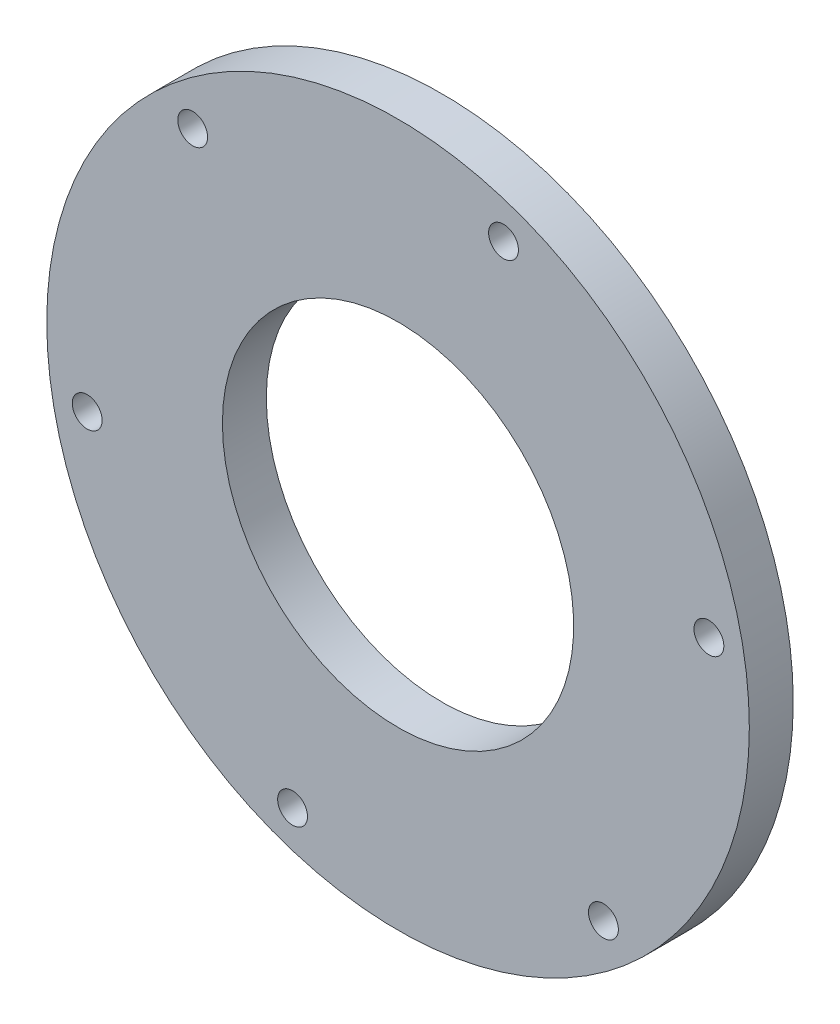
ISO-10303-21;
HEADER;
FILE_DESCRIPTION(('STEP AP214'),'2;1');
FILE_NAME('part.step','',(''),(''),'','','');
FILE_SCHEMA(('AUTOMOTIVE_DESIGN { 1 0 10303 214 1 1 1 1 }'));
ENDSEC;
DATA;
#1=APPLICATION_CONTEXT('core data for automotive mechanical design processes');
#2=APPLICATION_PROTOCOL_DEFINITION('international standard','automotive_design',2000,#1);
#3=PRODUCT_CONTEXT('',#1,'mechanical');
#4=PRODUCT('Part','Part','',(#3));
#5=PRODUCT_RELATED_PRODUCT_CATEGORY('part','',(#4));
#6=PRODUCT_DEFINITION_FORMATION('','',#4);
#7=PRODUCT_DEFINITION_CONTEXT('part definition',#1,'design');
#8=PRODUCT_DEFINITION('design','',#6,#7);
#9=PRODUCT_DEFINITION_SHAPE('','',#8);
#10=(LENGTH_UNIT() NAMED_UNIT(*) SI_UNIT(.MILLI.,.METRE.));
#11=(NAMED_UNIT(*) PLANE_ANGLE_UNIT() SI_UNIT($,.RADIAN.));
#12=(NAMED_UNIT(*) SI_UNIT($,.STERADIAN.) SOLID_ANGLE_UNIT());
#13=UNCERTAINTY_MEASURE_WITH_UNIT(LENGTH_MEASURE(1.E-05),#10,'distance_accuracy_value','');
#14=(GEOMETRIC_REPRESENTATION_CONTEXT(3) GLOBAL_UNCERTAINTY_ASSIGNED_CONTEXT((#13)) GLOBAL_UNIT_ASSIGNED_CONTEXT((#10,
#11,#12)) REPRESENTATION_CONTEXT('',''));
#15=CARTESIAN_POINT('',(0.,0.,0.));
#16=DIRECTION('',(0.,0.,1.));
#17=DIRECTION('',(1.,0.,0.));
#18=AXIS2_PLACEMENT_3D('',#15,#16,#17);
#19=CARTESIAN_POINT('',(0.,0.,5.));
#20=DIRECTION('',(0.,0.,-1.));
#21=DIRECTION('',(-1.,0.,0.));
#22=AXIS2_PLACEMENT_3D('',#19,#20,#21);
#23=CYLINDRICAL_SURFACE('',#22,40.);
#24=CARTESIAN_POINT('',(0.,0.,5.));
#25=DIRECTION('',(0.,0.,1.));
#26=DIRECTION('',(1.,0.,0.));
#27=AXIS2_PLACEMENT_3D('',#24,#25,#26);
#28=CIRCLE('',#27,40.);
#29=CARTESIAN_POINT('',(40.,0.,5.));
#30=VERTEX_POINT('',#29);
#31=EDGE_CURVE('E10',#30,#30,#28,.T.);
#32=ORIENTED_EDGE('',*,*,#31,.F.);
#33=EDGE_LOOP('',(#32));
#34=FACE_BOUND('',#33,.T.);
#35=CARTESIAN_POINT('',(0.,0.,0.));
#36=DIRECTION('',(0.,0.,1.));
#37=DIRECTION('',(1.,0.,0.));
#38=AXIS2_PLACEMENT_3D('',#35,#36,#37);
#39=CIRCLE('',#38,40.);
#40=CARTESIAN_POINT('',(40.,0.,0.));
#41=VERTEX_POINT('',#40);
#42=EDGE_CURVE('E33',#41,#41,#39,.T.);
#43=ORIENTED_EDGE('',*,*,#42,.T.);
#44=EDGE_LOOP('',(#43));
#45=FACE_BOUND('',#44,.T.);
#46=ADVANCED_FACE('F30',(#34,#45),#23,.T.);
#47=CARTESIAN_POINT('',(0.,0.,5.));
#48=DIRECTION('',(0.,0.,1.));
#49=DIRECTION('',(1.,0.,0.));
#50=AXIS2_PLACEMENT_3D('',#47,#48,#49);
#51=PLANE('',#50);
#52=CARTESIAN_POINT('',(-23.3864490950363,27.3692162607057,5.));
#53=DIRECTION('',(0.,0.,1.));
#54=DIRECTION('',(1.,0.,0.));
#55=AXIS2_PLACEMENT_3D('',#52,#53,#54);
#56=CIRCLE('',#55,1.7);
#57=CARTESIAN_POINT('',(-21.6864490950363,27.3692162607057,5.));
#58=VERTEX_POINT('',#57);
#59=EDGE_CURVE('E78',#58,#58,#56,.T.);
#60=ORIENTED_EDGE('',*,*,#59,.F.);
#61=EDGE_LOOP('',(#60));
#62=FACE_BOUND('',#61,.T.);
#63=CARTESIAN_POINT('',(-35.3956611109594,-6.56865089026032,5.));
#64=DIRECTION('',(0.,0.,1.));
#65=DIRECTION('',(1.,0.,0.));
#66=AXIS2_PLACEMENT_3D('',#63,#64,#65);
#67=CIRCLE('',#66,1.69999999999999);
#68=CARTESIAN_POINT('',(-33.6956611109594,-6.56865089026032,5.));
#69=VERTEX_POINT('',#68);
#70=EDGE_CURVE('E72',#69,#69,#67,.T.);
#71=ORIENTED_EDGE('',*,*,#70,.F.);
#72=EDGE_LOOP('',(#71));
#73=FACE_BOUND('',#72,.T.);
#74=CARTESIAN_POINT('',(-12.0092120159229,-33.9378671509659,5.));
#75=DIRECTION('',(0.,0.,1.));
#76=DIRECTION('',(1.,0.,0.));
#77=AXIS2_PLACEMENT_3D('',#74,#75,#76);
#78=CIRCLE('',#77,1.7);
#79=CARTESIAN_POINT('',(-10.3092120159229,-33.9378671509659,5.));
#80=VERTEX_POINT('',#79);
#81=EDGE_CURVE('E66',#80,#80,#78,.T.);
#82=ORIENTED_EDGE('',*,*,#81,.F.);
#83=EDGE_LOOP('',(#82));
#84=FACE_BOUND('',#83,.T.);
#85=CARTESIAN_POINT('',(23.3864490950365,-27.3692162607055,5.));
#86=DIRECTION('',(0.,0.,1.));
#87=DIRECTION('',(1.,0.,0.));
#88=AXIS2_PLACEMENT_3D('',#85,#86,#87);
#89=CIRCLE('',#88,1.7);
#90=CARTESIAN_POINT('',(25.0864490950365,-27.3692162607055,5.));
#91=VERTEX_POINT('',#90);
#92=EDGE_CURVE('E60',#91,#91,#89,.T.);
#93=ORIENTED_EDGE('',*,*,#92,.F.);
#94=EDGE_LOOP('',(#93));
#95=FACE_BOUND('',#94,.T.);
#96=CARTESIAN_POINT('',(35.3956611109593,6.56865089026056,5.));
#97=DIRECTION('',(0.,0.,1.));
#98=DIRECTION('',(1.,0.,0.));
#99=AXIS2_PLACEMENT_3D('',#96,#97,#98);
#100=CIRCLE('',#99,1.69999999999999);
#101=CARTESIAN_POINT('',(37.0956611109593,6.56865089026056,5.));
#102=VERTEX_POINT('',#101);
#103=EDGE_CURVE('E54',#102,#102,#100,.T.);
#104=ORIENTED_EDGE('',*,*,#103,.F.);
#105=EDGE_LOOP('',(#104));
#106=FACE_BOUND('',#105,.T.);
#107=CARTESIAN_POINT('',(12.0092120159227,33.937867150966,5.));
#108=DIRECTION('',(0.,0.,1.));
#109=DIRECTION('',(1.,0.,0.));
#110=AXIS2_PLACEMENT_3D('',#107,#108,#109);
#111=CIRCLE('',#110,1.7);
#112=CARTESIAN_POINT('',(13.7092120159227,33.937867150966,5.));
#113=VERTEX_POINT('',#112);
#114=EDGE_CURVE('E48',#113,#113,#111,.T.);
#115=ORIENTED_EDGE('',*,*,#114,.F.);
#116=EDGE_LOOP('',(#115));
#117=FACE_BOUND('',#116,.T.);
#118=CARTESIAN_POINT('',(0.,0.,5.));
#119=DIRECTION('',(0.,0.,-1.));
#120=DIRECTION('',(-1.,0.,0.));
#121=AXIS2_PLACEMENT_3D('',#118,#119,#120);
#122=CIRCLE('',#121,20.);
#123=CARTESIAN_POINT('',(-20.,0.,5.));
#124=VERTEX_POINT('',#123);
#125=EDGE_CURVE('E40',#124,#124,#122,.T.);
#126=ORIENTED_EDGE('',*,*,#125,.T.);
#127=EDGE_LOOP('',(#126));
#128=FACE_BOUND('',#127,.T.);
#129=ORIENTED_EDGE('',*,*,#31,.T.);
#130=EDGE_LOOP('',(#129));
#131=FACE_BOUND('',#130,.T.);
#132=ADVANCED_FACE('F94',(#62,#73,#84,#95,#106,#117,#128,#131),#51,.T.);
#133=CARTESIAN_POINT('',(0.,0.,0.));
#134=DIRECTION('',(0.,0.,1.));
#135=DIRECTION('',(1.,0.,0.));
#136=AXIS2_PLACEMENT_3D('',#133,#134,#135);
#137=PLANE('',#136);
#138=CARTESIAN_POINT('',(-23.3864490950363,27.3692162607057,0.));
#139=DIRECTION('',(0.,0.,1.));
#140=DIRECTION('',(1.,0.,0.));
#141=AXIS2_PLACEMENT_3D('',#138,#139,#140);
#142=CIRCLE('',#141,1.7);
#143=CARTESIAN_POINT('',(-21.6864490950363,27.3692162607057,0.));
#144=VERTEX_POINT('',#143);
#145=EDGE_CURVE('E75',#144,#144,#142,.T.);
#146=ORIENTED_EDGE('',*,*,#145,.T.);
#147=EDGE_LOOP('',(#146));
#148=FACE_BOUND('',#147,.T.);
#149=CARTESIAN_POINT('',(-35.3956611109594,-6.56865089026032,0.));
#150=DIRECTION('',(0.,0.,1.));
#151=DIRECTION('',(1.,0.,0.));
#152=AXIS2_PLACEMENT_3D('',#149,#150,#151);
#153=CIRCLE('',#152,1.69999999999999);
#154=CARTESIAN_POINT('',(-33.6956611109594,-6.56865089026032,0.));
#155=VERTEX_POINT('',#154);
#156=EDGE_CURVE('E69',#155,#155,#153,.T.);
#157=ORIENTED_EDGE('',*,*,#156,.T.);
#158=EDGE_LOOP('',(#157));
#159=FACE_BOUND('',#158,.T.);
#160=CARTESIAN_POINT('',(-12.0092120159229,-33.9378671509659,0.));
#161=DIRECTION('',(0.,0.,1.));
#162=DIRECTION('',(1.,0.,0.));
#163=AXIS2_PLACEMENT_3D('',#160,#161,#162);
#164=CIRCLE('',#163,1.7);
#165=CARTESIAN_POINT('',(-10.3092120159229,-33.9378671509659,0.));
#166=VERTEX_POINT('',#165);
#167=EDGE_CURVE('E63',#166,#166,#164,.T.);
#168=ORIENTED_EDGE('',*,*,#167,.T.);
#169=EDGE_LOOP('',(#168));
#170=FACE_BOUND('',#169,.T.);
#171=CARTESIAN_POINT('',(23.3864490950365,-27.3692162607055,0.));
#172=DIRECTION('',(0.,0.,1.));
#173=DIRECTION('',(1.,0.,0.));
#174=AXIS2_PLACEMENT_3D('',#171,#172,#173);
#175=CIRCLE('',#174,1.7);
#176=CARTESIAN_POINT('',(25.0864490950365,-27.3692162607055,0.));
#177=VERTEX_POINT('',#176);
#178=EDGE_CURVE('E57',#177,#177,#175,.T.);
#179=ORIENTED_EDGE('',*,*,#178,.T.);
#180=EDGE_LOOP('',(#179));
#181=FACE_BOUND('',#180,.T.);
#182=CARTESIAN_POINT('',(35.3956611109593,6.56865089026056,0.));
#183=DIRECTION('',(0.,0.,1.));
#184=DIRECTION('',(1.,0.,0.));
#185=AXIS2_PLACEMENT_3D('',#182,#183,#184);
#186=CIRCLE('',#185,1.69999999999999);
#187=CARTESIAN_POINT('',(37.0956611109593,6.56865089026056,0.));
#188=VERTEX_POINT('',#187);
#189=EDGE_CURVE('E51',#188,#188,#186,.T.);
#190=ORIENTED_EDGE('',*,*,#189,.T.);
#191=EDGE_LOOP('',(#190));
#192=FACE_BOUND('',#191,.T.);
#193=CARTESIAN_POINT('',(12.0092120159227,33.937867150966,0.));
#194=DIRECTION('',(0.,0.,1.));
#195=DIRECTION('',(1.,0.,0.));
#196=AXIS2_PLACEMENT_3D('',#193,#194,#195);
#197=CIRCLE('',#196,1.7);
#198=CARTESIAN_POINT('',(13.7092120159227,33.937867150966,0.));
#199=VERTEX_POINT('',#198);
#200=EDGE_CURVE('E45',#199,#199,#197,.T.);
#201=ORIENTED_EDGE('',*,*,#200,.T.);
#202=EDGE_LOOP('',(#201));
#203=FACE_BOUND('',#202,.T.);
#204=CARTESIAN_POINT('',(0.,0.,0.));
#205=DIRECTION('',(0.,0.,-1.));
#206=DIRECTION('',(-1.,0.,0.));
#207=AXIS2_PLACEMENT_3D('',#204,#205,#206);
#208=CIRCLE('',#207,20.);
#209=CARTESIAN_POINT('',(-20.,0.,0.));
#210=VERTEX_POINT('',#209);
#211=EDGE_CURVE('E42',#210,#210,#208,.T.);
#212=ORIENTED_EDGE('',*,*,#211,.F.);
#213=EDGE_LOOP('',(#212));
#214=FACE_BOUND('',#213,.T.);
#215=ORIENTED_EDGE('',*,*,#42,.F.);
#216=EDGE_LOOP('',(#215));
#217=FACE_BOUND('',#216,.T.);
#218=ADVANCED_FACE('F84',(#148,#159,#170,#181,#192,#203,#214,#217),#137,.F.);
#219=CARTESIAN_POINT('',(0.,0.,5.));
#220=DIRECTION('',(0.,0.,-1.));
#221=DIRECTION('',(-1.,0.,0.));
#222=AXIS2_PLACEMENT_3D('',#219,#220,#221);
#223=CYLINDRICAL_SURFACE('',#222,20.);
#224=ORIENTED_EDGE('',*,*,#125,.F.);
#225=EDGE_LOOP('',(#224));
#226=FACE_BOUND('',#225,.T.);
#227=ORIENTED_EDGE('',*,*,#211,.T.);
#228=EDGE_LOOP('',(#227));
#229=FACE_BOUND('',#228,.T.);
#230=ADVANCED_FACE('F110',(#226,#229),#223,.F.);
#231=CARTESIAN_POINT('',(12.0092120159227,33.937867150966,0.));
#232=DIRECTION('',(0.,0.,1.));
#233=DIRECTION('',(1.,0.,0.));
#234=AXIS2_PLACEMENT_3D('',#231,#232,#233);
#235=CYLINDRICAL_SURFACE('',#234,1.7);
#236=ORIENTED_EDGE('',*,*,#200,.F.);
#237=EDGE_LOOP('',(#236));
#238=FACE_BOUND('',#237,.T.);
#239=ORIENTED_EDGE('',*,*,#114,.T.);
#240=EDGE_LOOP('',(#239));
#241=FACE_BOUND('',#240,.T.);
#242=ADVANCED_FACE('F113',(#238,#241),#235,.F.);
#243=CARTESIAN_POINT('',(35.3956611109593,6.56865089026056,0.));
#244=DIRECTION('',(0.,0.,1.));
#245=DIRECTION('',(1.,0.,0.));
#246=AXIS2_PLACEMENT_3D('',#243,#244,#245);
#247=CYLINDRICAL_SURFACE('',#246,1.69999999999999);
#248=ORIENTED_EDGE('',*,*,#189,.F.);
#249=EDGE_LOOP('',(#248));
#250=FACE_BOUND('',#249,.T.);
#251=ORIENTED_EDGE('',*,*,#103,.T.);
#252=EDGE_LOOP('',(#251));
#253=FACE_BOUND('',#252,.T.);
#254=ADVANCED_FACE('F143',(#250,#253),#247,.F.);
#255=CARTESIAN_POINT('',(23.3864490950365,-27.3692162607055,0.));
#256=DIRECTION('',(0.,0.,1.));
#257=DIRECTION('',(1.,0.,0.));
#258=AXIS2_PLACEMENT_3D('',#255,#256,#257);
#259=CYLINDRICAL_SURFACE('',#258,1.7);
#260=ORIENTED_EDGE('',*,*,#178,.F.);
#261=EDGE_LOOP('',(#260));
#262=FACE_BOUND('',#261,.T.);
#263=ORIENTED_EDGE('',*,*,#92,.T.);
#264=EDGE_LOOP('',(#263));
#265=FACE_BOUND('',#264,.T.);
#266=ADVANCED_FACE('F151',(#262,#265),#259,.F.);
#267=CARTESIAN_POINT('',(-12.0092120159229,-33.9378671509659,0.));
#268=DIRECTION('',(0.,0.,1.));
#269=DIRECTION('',(1.,0.,0.));
#270=AXIS2_PLACEMENT_3D('',#267,#268,#269);
#271=CYLINDRICAL_SURFACE('',#270,1.7);
#272=ORIENTED_EDGE('',*,*,#167,.F.);
#273=EDGE_LOOP('',(#272));
#274=FACE_BOUND('',#273,.T.);
#275=ORIENTED_EDGE('',*,*,#81,.T.);
#276=EDGE_LOOP('',(#275));
#277=FACE_BOUND('',#276,.T.);
#278=ADVANCED_FACE('F159',(#274,#277),#271,.F.);
#279=CARTESIAN_POINT('',(-35.3956611109594,-6.56865089026032,0.));
#280=DIRECTION('',(0.,0.,1.));
#281=DIRECTION('',(1.,0.,0.));
#282=AXIS2_PLACEMENT_3D('',#279,#280,#281);
#283=CYLINDRICAL_SURFACE('',#282,1.69999999999999);
#284=ORIENTED_EDGE('',*,*,#156,.F.);
#285=EDGE_LOOP('',(#284));
#286=FACE_BOUND('',#285,.T.);
#287=ORIENTED_EDGE('',*,*,#70,.T.);
#288=EDGE_LOOP('',(#287));
#289=FACE_BOUND('',#288,.T.);
#290=ADVANCED_FACE('F90',(#286,#289),#283,.F.);
#291=CARTESIAN_POINT('',(-23.3864490950363,27.3692162607057,0.));
#292=DIRECTION('',(0.,0.,1.));
#293=DIRECTION('',(1.,0.,0.));
#294=AXIS2_PLACEMENT_3D('',#291,#292,#293);
#295=CYLINDRICAL_SURFACE('',#294,1.7);
#296=ORIENTED_EDGE('',*,*,#145,.F.);
#297=EDGE_LOOP('',(#296));
#298=FACE_BOUND('',#297,.T.);
#299=ORIENTED_EDGE('',*,*,#59,.T.);
#300=EDGE_LOOP('',(#299));
#301=FACE_BOUND('',#300,.T.);
#302=ADVANCED_FACE('F87',(#298,#301),#295,.F.);
#303=CLOSED_SHELL('',(#46,#132,#218,#230,#242,#254,#266,#278,#290,#302));
#304=MANIFOLD_SOLID_BREP('B2',#303);
#305=ADVANCED_BREP_SHAPE_REPRESENTATION('',(#18,#304),#14);
#306=SHAPE_DEFINITION_REPRESENTATION(#9,#305);
ENDSEC;
END-ISO-10303-21;
